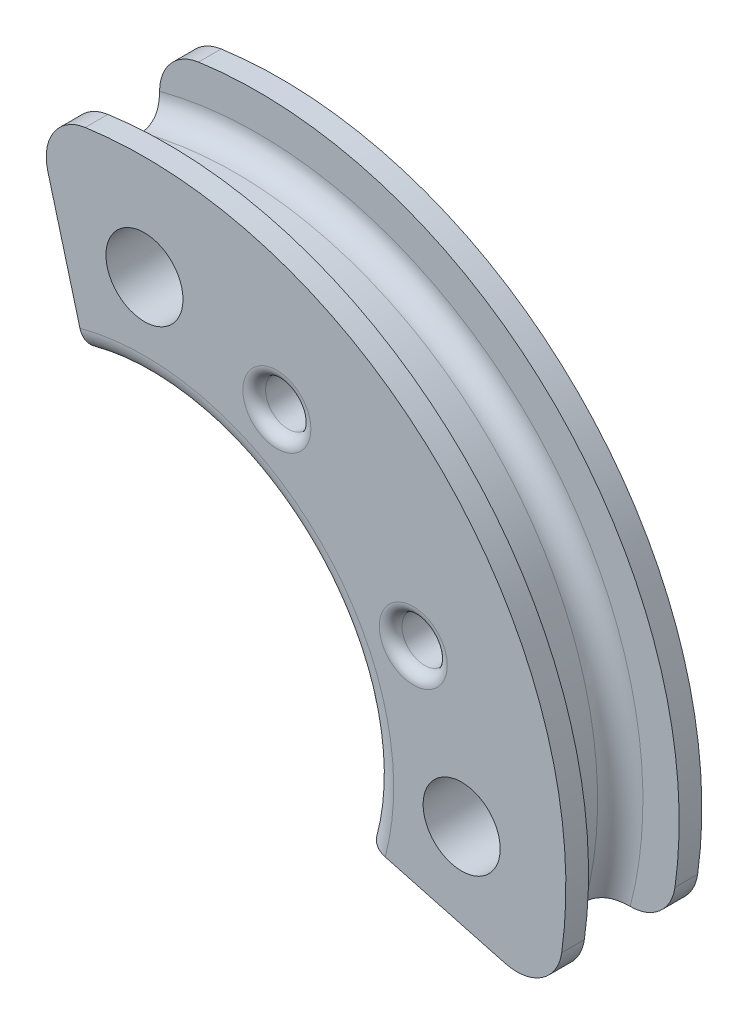
ISO-10303-21;
HEADER;
FILE_DESCRIPTION(('STEP AP214'),'2;1');
FILE_NAME('part.step','',(''),(''),'','','');
FILE_SCHEMA(('AUTOMOTIVE_DESIGN { 1 0 10303 214 1 1 1 1 }'));
ENDSEC;
DATA;
#1=APPLICATION_CONTEXT('core data for automotive mechanical design processes');
#2=APPLICATION_PROTOCOL_DEFINITION('international standard','automotive_design',2000,#1);
#3=PRODUCT_CONTEXT('',#1,'mechanical');
#4=PRODUCT('Part','Part','',(#3));
#5=PRODUCT_RELATED_PRODUCT_CATEGORY('part','',(#4));
#6=PRODUCT_DEFINITION_FORMATION('','',#4);
#7=PRODUCT_DEFINITION_CONTEXT('part definition',#1,'design');
#8=PRODUCT_DEFINITION('design','',#6,#7);
#9=PRODUCT_DEFINITION_SHAPE('','',#8);
#10=(LENGTH_UNIT() NAMED_UNIT(*) SI_UNIT(.MILLI.,.METRE.));
#11=(NAMED_UNIT(*) PLANE_ANGLE_UNIT() SI_UNIT($,.RADIAN.));
#12=(NAMED_UNIT(*) SI_UNIT($,.STERADIAN.) SOLID_ANGLE_UNIT());
#13=UNCERTAINTY_MEASURE_WITH_UNIT(LENGTH_MEASURE(1.E-05),#10,'distance_accuracy_value','');
#14=(GEOMETRIC_REPRESENTATION_CONTEXT(3) GLOBAL_UNCERTAINTY_ASSIGNED_CONTEXT((#13)) GLOBAL_UNIT_ASSIGNED_CONTEXT((#10,
#11,#12)) REPRESENTATION_CONTEXT('',''));
#15=CARTESIAN_POINT('',(0.,0.,0.));
#16=DIRECTION('',(0.,0.,1.));
#17=DIRECTION('',(1.,0.,0.));
#18=AXIS2_PLACEMENT_3D('',#15,#16,#17);
#19=CARTESIAN_POINT('',(0.,0.,1.5));
#20=DIRECTION('',(0.,0.,1.));
#21=DIRECTION('',(1.,0.,0.));
#22=AXIS2_PLACEMENT_3D('',#19,#20,#21);
#23=PLANE('',#22);
#24=CARTESIAN_POINT('',(5.93230035185212,2.92235083903419,1.5));
#25=DIRECTION('',(0.,0.,1.));
#26=DIRECTION('',(1.,0.,0.));
#27=AXIS2_PLACEMENT_3D('',#24,#25,#26);
#28=CIRCLE('',#27,0.750000000000001);
#29=CARTESIAN_POINT('',(6.68230035185213,2.92235083903419,1.5));
#30=VERTEX_POINT('',#29);
#31=EDGE_CURVE('E345',#30,#30,#28,.F.);
#32=ORIENTED_EDGE('',*,*,#31,.T.);
#33=EDGE_LOOP('',(#32));
#34=FACE_BOUND('',#33,.T.);
#35=CARTESIAN_POINT('',(2.92235083903426,5.93230035185209,1.5));
#36=DIRECTION('',(0.,0.,1.));
#37=DIRECTION('',(1.,0.,0.));
#38=AXIS2_PLACEMENT_3D('',#35,#36,#37);
#39=CIRCLE('',#38,0.750000000000001);
#40=CARTESIAN_POINT('',(3.67235083903426,5.93230035185209,1.5));
#41=VERTEX_POINT('',#40);
#42=EDGE_CURVE('E342',#41,#41,#39,.F.);
#43=ORIENTED_EDGE('',*,*,#42,.T.);
#44=EDGE_LOOP('',(#43));
#45=FACE_BOUND('',#44,.T.);
#46=DIRECTION('',(-0.965925826289066,0.258819045102528,0.));
#47=VECTOR('',#46,1.);
#48=CARTESIAN_POINT('',(10.3501453744562,-2.77331309463034,1.5));
#49=LINE('',#48,#47);
#50=CARTESIAN_POINT('',(7.95878334492544,-2.1325495700071,1.5));
#51=VERTEX_POINT('',#50);
#52=CARTESIAN_POINT('',(5.31259204458986,-1.4235047480639,1.5));
#53=VERTEX_POINT('',#52);
#54=EDGE_CURVE('E362',#51,#53,#49,.T.);
#55=ORIENTED_EDGE('',*,*,#54,.F.);
#56=CARTESIAN_POINT('',(8.21760239002796,-1.16662374371804,1.5));
#57=DIRECTION('',(0.,0.,1.));
#58=DIRECTION('',(1.,0.,0.));
#59=AXIS2_PLACEMENT_3D('',#56,#57,#58);
#60=CIRCLE('',#59,1.);
#61=CARTESIAN_POINT('',(9.20767496713977,-1.30718082127443,1.5));
#62=VERTEX_POINT('',#61);
#63=EDGE_CURVE('E457',#51,#62,#60,.T.);
#64=ORIENTED_EDGE('',*,*,#63,.T.);
#65=CARTESIAN_POINT('',(0.,0.,1.5));
#66=DIRECTION('',(0.,0.,1.));
#67=DIRECTION('',(1.,0.,0.));
#68=AXIS2_PLACEMENT_3D('',#65,#66,#67);
#69=CIRCLE('',#68,9.3);
#70=CARTESIAN_POINT('',(-1.30718082127433,9.20767496713978,1.5));
#71=VERTEX_POINT('',#70);
#72=EDGE_CURVE('E508',#62,#71,#69,.T.);
#73=ORIENTED_EDGE('',*,*,#72,.T.);
#74=CARTESIAN_POINT('',(-1.16662374371795,8.21760239002798,1.5));
#75=DIRECTION('',(0.,0.,1.));
#76=DIRECTION('',(1.,0.,0.));
#77=AXIS2_PLACEMENT_3D('',#74,#75,#76);
#78=CIRCLE('',#77,1.);
#79=CARTESIAN_POINT('',(-2.13254957000702,7.95878334492546,1.5));
#80=VERTEX_POINT('',#79);
#81=EDGE_CURVE('E455',#71,#80,#78,.T.);
#82=ORIENTED_EDGE('',*,*,#81,.T.);
#83=DIRECTION('',(-0.258819045102518,0.965925826289069,0.));
#84=VECTOR('',#83,1.);
#85=CARTESIAN_POINT('',(-2.65426315247376,9.90584494169013,1.5));
#86=LINE('',#85,#84);
#87=CARTESIAN_POINT('',(-1.42350474806385,5.31259204458988,1.5));
#88=VERTEX_POINT('',#87);
#89=EDGE_CURVE('E485',#88,#80,#86,.T.);
#90=ORIENTED_EDGE('',*,*,#89,.F.);
#91=CARTESIAN_POINT('',(0.,0.,1.5));
#92=DIRECTION('',(0.,0.,1.));
#93=DIRECTION('',(1.,0.,0.));
#94=AXIS2_PLACEMENT_3D('',#91,#92,#93);
#95=CIRCLE('',#94,5.5);
#96=EDGE_CURVE('E208',#88,#53,#95,.F.);
#97=ORIENTED_EDGE('',*,*,#96,.T.);
#98=EDGE_LOOP('',(#55,#64,#73,#82,#90,#97));
#99=FACE_BOUND('',#98,.T.);
#100=CARTESIAN_POINT('',(7.,0.,1.5));
#101=DIRECTION('',(0.,0.,1.));
#102=DIRECTION('',(1.,0.,0.));
#103=AXIS2_PLACEMENT_3D('',#100,#101,#102);
#104=CIRCLE('',#103,0.849999999999999);
#105=CARTESIAN_POINT('',(7.85,0.,1.5));
#106=VERTEX_POINT('',#105);
#107=EDGE_CURVE('E196',#106,#106,#104,.T.);
#108=ORIENTED_EDGE('',*,*,#107,.F.);
#109=EDGE_LOOP('',(#108));
#110=FACE_BOUND('',#109,.T.);
#111=CARTESIAN_POINT('',(0.,7.,1.5));
#112=DIRECTION('',(0.,0.,1.));
#113=DIRECTION('',(1.,0.,0.));
#114=AXIS2_PLACEMENT_3D('',#111,#112,#113);
#115=CIRCLE('',#114,0.85);
#116=CARTESIAN_POINT('',(0.850000000000001,7.,1.5));
#117=VERTEX_POINT('',#116);
#118=EDGE_CURVE('E187',#117,#117,#115,.T.);
#119=ORIENTED_EDGE('',*,*,#118,.F.);
#120=EDGE_LOOP('',(#119));
#121=FACE_BOUND('',#120,.T.);
#122=ADVANCED_FACE('F32',(#34,#45,#99,#110,#121),#23,.T.);
#123=CARTESIAN_POINT('',(0.,0.,-1.5));
#124=DIRECTION('',(0.,0.,1.));
#125=DIRECTION('',(1.,0.,0.));
#126=AXIS2_PLACEMENT_3D('',#123,#124,#125);
#127=PLANE('',#126);
#128=CARTESIAN_POINT('',(5.93230035185212,2.92235083903419,-1.5));
#129=DIRECTION('',(0.,0.,1.));
#130=DIRECTION('',(1.,0.,0.));
#131=AXIS2_PLACEMENT_3D('',#128,#129,#130);
#132=CIRCLE('',#131,0.750000000000001);
#133=CARTESIAN_POINT('',(6.68230035185213,2.92235083903419,-1.5));
#134=VERTEX_POINT('',#133);
#135=EDGE_CURVE('E333',#134,#134,#132,.T.);
#136=ORIENTED_EDGE('',*,*,#135,.T.);
#137=EDGE_LOOP('',(#136));
#138=FACE_BOUND('',#137,.T.);
#139=CARTESIAN_POINT('',(2.92235083903426,5.93230035185209,-1.5));
#140=DIRECTION('',(0.,0.,1.));
#141=DIRECTION('',(1.,0.,0.));
#142=AXIS2_PLACEMENT_3D('',#139,#140,#141);
#143=CIRCLE('',#142,0.750000000000001);
#144=CARTESIAN_POINT('',(3.67235083903426,5.93230035185209,-1.5));
#145=VERTEX_POINT('',#144);
#146=EDGE_CURVE('E330',#145,#145,#143,.T.);
#147=ORIENTED_EDGE('',*,*,#146,.T.);
#148=EDGE_LOOP('',(#147));
#149=FACE_BOUND('',#148,.T.);
#150=CARTESIAN_POINT('',(0.,0.,-1.5));
#151=DIRECTION('',(0.,0.,1.));
#152=DIRECTION('',(1.,0.,0.));
#153=AXIS2_PLACEMENT_3D('',#150,#151,#152);
#154=CIRCLE('',#153,5.5);
#155=CARTESIAN_POINT('',(5.46625,0.608367436258737,-1.5));
#156=VERTEX_POINT('',#155);
#157=CARTESIAN_POINT('',(0.608367436258713,5.46625,-1.5));
#158=VERTEX_POINT('',#157);
#159=EDGE_CURVE('E221',#156,#158,#154,.T.);
#160=ORIENTED_EDGE('',*,*,#159,.T.);
#161=CARTESIAN_POINT('',(0.,7.,-1.5));
#162=DIRECTION('',(0.,0.,1.));
#163=DIRECTION('',(1.,0.,0.));
#164=AXIS2_PLACEMENT_3D('',#161,#162,#163);
#165=CIRCLE('',#164,1.65);
#166=CARTESIAN_POINT('',(-0.608367436258712,5.46625,-1.5));
#167=VERTEX_POINT('',#166);
#168=EDGE_CURVE('E478',#158,#167,#165,.T.);
#169=ORIENTED_EDGE('',*,*,#168,.T.);
#170=CARTESIAN_POINT('',(-1.42350474806385,5.31259204458988,-1.5));
#171=VERTEX_POINT('',#170);
#172=EDGE_CURVE('E216',#167,#171,#154,.T.);
#173=ORIENTED_EDGE('',*,*,#172,.T.);
#174=DIRECTION('',(-0.258819045102518,0.965925826289069,0.));
#175=VECTOR('',#174,1.);
#176=CARTESIAN_POINT('',(-2.65426315247376,9.90584494169013,-1.5));
#177=LINE('',#176,#175);
#178=CARTESIAN_POINT('',(-2.13254957000702,7.95878334492546,-1.5));
#179=VERTEX_POINT('',#178);
#180=EDGE_CURVE('E168',#171,#179,#177,.T.);
#181=ORIENTED_EDGE('',*,*,#180,.T.);
#182=CARTESIAN_POINT('',(-1.16662374371795,8.21760239002798,-1.5));
#183=DIRECTION('',(0.,0.,1.));
#184=DIRECTION('',(1.,0.,0.));
#185=AXIS2_PLACEMENT_3D('',#182,#183,#184);
#186=CIRCLE('',#185,1.);
#187=CARTESIAN_POINT('',(-1.30718082127433,9.20767496713978,-1.5));
#188=VERTEX_POINT('',#187);
#189=EDGE_CURVE('E448',#179,#188,#186,.F.);
#190=ORIENTED_EDGE('',*,*,#189,.T.);
#191=CARTESIAN_POINT('',(0.,0.,-1.5));
#192=DIRECTION('',(0.,0.,1.));
#193=DIRECTION('',(1.,0.,0.));
#194=AXIS2_PLACEMENT_3D('',#191,#192,#193);
#195=CIRCLE('',#194,9.3);
#196=CARTESIAN_POINT('',(9.20767496713977,-1.30718082127443,-1.5));
#197=VERTEX_POINT('',#196);
#198=EDGE_CURVE('E440',#197,#188,#195,.T.);
#199=ORIENTED_EDGE('',*,*,#198,.F.);
#200=CARTESIAN_POINT('',(8.21760239002796,-1.16662374371804,-1.5));
#201=DIRECTION('',(0.,0.,1.));
#202=DIRECTION('',(1.,0.,0.));
#203=AXIS2_PLACEMENT_3D('',#200,#201,#202);
#204=CIRCLE('',#203,1.);
#205=CARTESIAN_POINT('',(7.95878334492544,-2.1325495700071,-1.5));
#206=VERTEX_POINT('',#205);
#207=EDGE_CURVE('E447',#197,#206,#204,.F.);
#208=ORIENTED_EDGE('',*,*,#207,.T.);
#209=DIRECTION('',(-0.965925826289066,0.258819045102528,0.));
#210=VECTOR('',#209,1.);
#211=CARTESIAN_POINT('',(10.3501453744562,-2.77331309463034,-1.5));
#212=LINE('',#211,#210);
#213=CARTESIAN_POINT('',(5.31259204458986,-1.4235047480639,-1.5));
#214=VERTEX_POINT('',#213);
#215=EDGE_CURVE('E484',#206,#214,#212,.T.);
#216=ORIENTED_EDGE('',*,*,#215,.T.);
#217=CARTESIAN_POINT('',(5.46625,-0.608367436258739,-1.5));
#218=VERTEX_POINT('',#217);
#219=EDGE_CURVE('E217',#214,#218,#154,.T.);
#220=ORIENTED_EDGE('',*,*,#219,.T.);
#221=CARTESIAN_POINT('',(7.,0.,-1.5));
#222=DIRECTION('',(0.,0.,1.));
#223=DIRECTION('',(1.,0.,0.));
#224=AXIS2_PLACEMENT_3D('',#221,#222,#223);
#225=CIRCLE('',#224,1.65000000000001);
#226=EDGE_CURVE('E474',#218,#156,#225,.T.);
#227=ORIENTED_EDGE('',*,*,#226,.T.);
#228=EDGE_LOOP('',(#160,#169,#173,#181,#190,#199,#208,#216,#220,#227));
#229=FACE_BOUND('',#228,.T.);
#230=ADVANCED_FACE('F288',(#138,#149,#229),#127,.F.);
#231=CARTESIAN_POINT('',(0.,0.,1.5));
#232=DIRECTION('',(0.,0.,-1.));
#233=DIRECTION('',(-1.,0.,0.));
#234=AXIS2_PLACEMENT_3D('',#231,#232,#233);
#235=CYLINDRICAL_SURFACE('',#234,5.);
#236=DIRECTION('',(0.,0.,-1.));
#237=VECTOR('',#236,1.);
#238=CARTESIAN_POINT('',(4.82962913144533,-1.29409522551264,1.5));
#239=LINE('',#238,#237);
#240=CARTESIAN_POINT('',(4.82962913144533,-1.29409522551264,1.));
#241=VERTEX_POINT('',#240);
#242=CARTESIAN_POINT('',(4.82962913144533,-1.29409522551264,-1.));
#243=VERTEX_POINT('',#242);
#244=EDGE_CURVE('E489',#241,#243,#239,.T.);
#245=ORIENTED_EDGE('',*,*,#244,.F.);
#246=CARTESIAN_POINT('',(0.,0.,1.));
#247=DIRECTION('',(0.,0.,1.));
#248=DIRECTION('',(1.,0.,0.));
#249=AXIS2_PLACEMENT_3D('',#246,#247,#248);
#250=CIRCLE('',#249,5.);
#251=CARTESIAN_POINT('',(-1.29409522551259,4.82962913144534,1.));
#252=VERTEX_POINT('',#251);
#253=EDGE_CURVE('E201',#241,#252,#250,.T.);
#254=ORIENTED_EDGE('',*,*,#253,.T.);
#255=DIRECTION('',(0.,0.,-1.));
#256=VECTOR('',#255,1.);
#257=CARTESIAN_POINT('',(-1.29409522551259,4.82962913144534,1.5));
#258=LINE('',#257,#256);
#259=CARTESIAN_POINT('',(-1.29409522551259,4.82962913144534,-1.));
#260=VERTEX_POINT('',#259);
#261=EDGE_CURVE('E497',#260,#252,#258,.F.);
#262=ORIENTED_EDGE('',*,*,#261,.F.);
#263=CARTESIAN_POINT('',(0.,0.,-1.));
#264=DIRECTION('',(0.,0.,1.));
#265=DIRECTION('',(1.,0.,0.));
#266=AXIS2_PLACEMENT_3D('',#263,#264,#265);
#267=CIRCLE('',#266,5.);
#268=EDGE_CURVE('E199',#260,#243,#267,.F.);
#269=ORIENTED_EDGE('',*,*,#268,.T.);
#270=EDGE_LOOP('',(#245,#254,#262,#269));
#271=FACE_BOUND('',#270,.T.);
#272=ADVANCED_FACE('F294',(#271),#235,.F.);
#273=CARTESIAN_POINT('',(7.,0.,1.5));
#274=DIRECTION('',(0.,0.,-1.));
#275=DIRECTION('',(-1.,0.,0.));
#276=AXIS2_PLACEMENT_3D('',#273,#274,#275);
#277=CYLINDRICAL_SURFACE('',#276,0.849999999999999);
#278=CARTESIAN_POINT('',(7.,0.,-0.699999999999995));
#279=DIRECTION('',(0.,0.,1.));
#280=DIRECTION('',(1.,0.,0.));
#281=AXIS2_PLACEMENT_3D('',#278,#279,#280);
#282=CIRCLE('',#281,0.849999999999999);
#283=CARTESIAN_POINT('',(7.85,0.,-0.699999999999995));
#284=VERTEX_POINT('',#283);
#285=EDGE_CURVE('E327',#284,#284,#282,.F.);
#286=ORIENTED_EDGE('',*,*,#285,.T.);
#287=EDGE_LOOP('',(#286));
#288=FACE_BOUND('',#287,.T.);
#289=ORIENTED_EDGE('',*,*,#107,.T.);
#290=EDGE_LOOP('',(#289));
#291=FACE_BOUND('',#290,.T.);
#292=ADVANCED_FACE('F368',(#288,#291),#277,.F.);
#293=CARTESIAN_POINT('',(0.,7.,1.5));
#294=DIRECTION('',(0.,0.,-1.));
#295=DIRECTION('',(-1.,0.,0.));
#296=AXIS2_PLACEMENT_3D('',#293,#294,#295);
#297=CYLINDRICAL_SURFACE('',#296,0.85);
#298=CARTESIAN_POINT('',(0.,7.,-0.699999999999995));
#299=DIRECTION('',(0.,0.,1.));
#300=DIRECTION('',(1.,0.,0.));
#301=AXIS2_PLACEMENT_3D('',#298,#299,#300);
#302=CIRCLE('',#301,0.85);
#303=CARTESIAN_POINT('',(0.850000000000001,7.,-0.699999999999995));
#304=VERTEX_POINT('',#303);
#305=EDGE_CURVE('E324',#304,#304,#302,.F.);
#306=ORIENTED_EDGE('',*,*,#305,.T.);
#307=EDGE_LOOP('',(#306));
#308=FACE_BOUND('',#307,.T.);
#309=ORIENTED_EDGE('',*,*,#118,.T.);
#310=EDGE_LOOP('',(#309));
#311=FACE_BOUND('',#310,.T.);
#312=ADVANCED_FACE('F285',(#308,#311),#297,.F.);
#313=CARTESIAN_POINT('',(0.,0.,-0.499999999999999));
#314=DIRECTION('',(0.,0.,1.));
#315=DIRECTION('',(1.,0.,0.));
#316=AXIS2_PLACEMENT_3D('',#313,#314,#315);
#317=TOROIDAL_SURFACE('',#316,8.5,0.500000000000001);
#318=CARTESIAN_POINT('',(8.21036952345707,-2.19996188337149,-0.499999999999999));
#319=DIRECTION('',(0.258819045102528,0.965925826289066,0.));
#320=DIRECTION('',(-0.965925826289067,0.258819045102528,0.));
#321=AXIS2_PLACEMENT_3D('',#318,#319,#320);
#322=CIRCLE('',#321,0.500000000000001);
#323=CARTESIAN_POINT('',(7.95878334492544,-2.1325495700071,-0.92680203230387));
#324=VERTEX_POINT('',#323);
#325=CARTESIAN_POINT('',(7.72740661031253,-2.07055236082022,-0.499999999999999));
#326=VERTEX_POINT('',#325);
#327=EDGE_CURVE('E504',#324,#326,#322,.T.);
#328=ORIENTED_EDGE('',*,*,#327,.F.);
#329=CARTESIAN_POINT('',(7.95878334492544,-2.1325495700071,-0.92680203230387));
#330=CARTESIAN_POINT('',(7.98032312676728,-2.1383521577099,-0.940458247360537));
#331=CARTESIAN_POINT('',(8.00315172706614,-2.14366644102367,-0.952309263321304));
#332=CARTESIAN_POINT('',(8.05008081458118,-2.15276681468098,-0.971949154373012));
#333=CARTESIAN_POINT('',(8.07413510467996,-2.15658785745952,-0.979832365841142));
#334=CARTESIAN_POINT('',(8.11816081402254,-2.16186027066998,-0.990524061954298));
#335=CARTESIAN_POINT('',(8.13792128141101,-2.16364171413765,-0.994052781450043));
#336=CARTESIAN_POINT('',(8.17819400886892,-2.16605713893131,-0.998819381859687));
#337=CARTESIAN_POINT('',(8.19871339056958,-2.16666717532724,-1.00000946956246));
#338=CARTESIAN_POINT('',(8.21923033471833,-2.1666224186152,-1.));
#339=B_SPLINE_CURVE_WITH_KNOTS('',3,(#329,#330,#331,#332,#333,#334,#335,#336,#337,#338),
.UNSPECIFIED.,.F.,.F.,(4,2,2,2,4),(0.,0.0783956304048873,0.154827082050498,0.215112414137625,
0.276617452457446),.UNSPECIFIED.);
#340=CARTESIAN_POINT('',(8.21923033471833,-2.16662241861519,-1.));
#341=VERTEX_POINT('',#340);
#342=EDGE_CURVE('E234',#324,#341,#339,.T.);
#343=ORIENTED_EDGE('',*,*,#342,.T.);
#344=CARTESIAN_POINT('',(0.,0.,-1.));
#345=DIRECTION('',(0.,0.,1.));
#346=DIRECTION('',(1.,0.,0.));
#347=AXIS2_PLACEMENT_3D('',#344,#345,#346);
#348=CIRCLE('',#347,8.5);
#349=CARTESIAN_POINT('',(-2.16662241861512,8.21923033471835,-1.));
#350=VERTEX_POINT('',#349);
#351=EDGE_CURVE('E190',#341,#350,#348,.T.);
#352=ORIENTED_EDGE('',*,*,#351,.T.);
#353=CARTESIAN_POINT('',(-2.16662241861512,8.21923033471835,-1.));
#354=CARTESIAN_POINT('',(-2.16670178233861,8.19307503880606,-1.00003724409534));
#355=CARTESIAN_POINT('',(-2.16568233287674,8.16690361720526,-0.998084843299811));
#356=CARTESIAN_POINT('',(-2.16175537254433,8.11596352609852,-0.990311504084287));
#357=CARTESIAN_POINT('',(-2.15889577707815,8.09117614124369,-0.984588656266716));
#358=CARTESIAN_POINT('',(-2.15234841258296,8.04813446073007,-0.970989152095519));
#359=CARTESIAN_POINT('',(-2.14896313895612,8.02960609001122,-0.963822721265301));
#360=CARTESIAN_POINT('',(-2.14134102498127,7.9933737424651,-0.947100013858474));
#361=CARTESIAN_POINT('',(-2.13708834014832,7.97569403191458,-0.93749831558258));
#362=CARTESIAN_POINT('',(-2.13254957000702,7.95878334492546,-0.92680203230387));
#363=B_SPLINE_CURVE_WITH_KNOTS('',3,(#353,#354,#355,#356,#357,#358,#359,#360,#361,#362),
.UNSPECIFIED.,.F.,.F.,(4,2,2,2,4),(0.,0.0783932173873378,0.154823502964689,0.215110524856777,
0.276617382951252),.UNSPECIFIED.);
#364=CARTESIAN_POINT('',(-2.13254957000702,7.95878334492546,-0.926802032303871));
#365=VERTEX_POINT('',#364);
#366=EDGE_CURVE('E227',#350,#365,#363,.T.);
#367=ORIENTED_EDGE('',*,*,#366,.T.);
#368=CARTESIAN_POINT('',(-2.1999618833714,8.21036952345709,-0.499999999999999));
#369=DIRECTION('',(0.965925826289069,0.258819045102518,0.));
#370=DIRECTION('',(-0.258819045102518,0.965925826289069,0.));
#371=AXIS2_PLACEMENT_3D('',#368,#369,#370);
#372=CIRCLE('',#371,0.500000000000001);
#373=CARTESIAN_POINT('',(-2.07055236082014,7.72740661031255,-0.499999999999999));
#374=VERTEX_POINT('',#373);
#375=EDGE_CURVE('E178',#374,#365,#372,.T.);
#376=ORIENTED_EDGE('',*,*,#375,.F.);
#377=CARTESIAN_POINT('',(0.,0.,-0.499999999999999));
#378=DIRECTION('',(0.,0.,1.));
#379=DIRECTION('',(1.,0.,0.));
#380=AXIS2_PLACEMENT_3D('',#377,#378,#379);
#381=CIRCLE('',#380,8.);
#382=EDGE_CURVE('E177',#326,#374,#381,.T.);
#383=ORIENTED_EDGE('',*,*,#382,.F.);
#384=EDGE_LOOP('',(#328,#343,#352,#367,#376,#383));
#385=FACE_BOUND('',#384,.T.);
#386=ADVANCED_FACE('F240',(#385),#317,.F.);
#387=CARTESIAN_POINT('',(0.,0.,0.));
#388=DIRECTION('',(0.,0.,1.));
#389=DIRECTION('',(1.,0.,0.));
#390=AXIS2_PLACEMENT_3D('',#387,#388,#389);
#391=CYLINDRICAL_SURFACE('',#390,8.);
#392=DIRECTION('',(0.,0.,1.));
#393=VECTOR('',#392,1.);
#394=CARTESIAN_POINT('',(7.72740661031253,-2.07055236082022,0.));
#395=LINE('',#394,#393);
#396=CARTESIAN_POINT('',(7.72740661031253,-2.07055236082022,0.499999999999999));
#397=VERTEX_POINT('',#396);
#398=EDGE_CURVE('E499',#326,#397,#395,.T.);
#399=ORIENTED_EDGE('',*,*,#398,.F.);
#400=ORIENTED_EDGE('',*,*,#382,.T.);
#401=DIRECTION('',(0.,0.,1.));
#402=VECTOR('',#401,1.);
#403=CARTESIAN_POINT('',(-2.07055236082014,7.72740661031255,0.));
#404=LINE('',#403,#402);
#405=CARTESIAN_POINT('',(-2.07055236082014,7.72740661031255,0.499999999999999));
#406=VERTEX_POINT('',#405);
#407=EDGE_CURVE('E161',#406,#374,#404,.F.);
#408=ORIENTED_EDGE('',*,*,#407,.F.);
#409=CARTESIAN_POINT('',(0.,0.,0.499999999999999));
#410=DIRECTION('',(0.,0.,1.));
#411=DIRECTION('',(1.,0.,0.));
#412=AXIS2_PLACEMENT_3D('',#409,#410,#411);
#413=CIRCLE('',#412,8.);
#414=EDGE_CURVE('E175',#397,#406,#413,.T.);
#415=ORIENTED_EDGE('',*,*,#414,.F.);
#416=EDGE_LOOP('',(#399,#400,#408,#415));
#417=FACE_BOUND('',#416,.T.);
#418=ADVANCED_FACE('F174',(#417),#391,.T.);
#419=CARTESIAN_POINT('',(0.,0.,0.5));
#420=DIRECTION('',(0.,0.,1.));
#421=DIRECTION('',(1.,0.,0.));
#422=AXIS2_PLACEMENT_3D('',#419,#420,#421);
#423=TOROIDAL_SURFACE('',#422,8.5,0.5);
#424=CARTESIAN_POINT('',(0.,0.,1.));
#425=DIRECTION('',(0.,0.,1.));
#426=DIRECTION('',(1.,0.,0.));
#427=AXIS2_PLACEMENT_3D('',#424,#425,#426);
#428=CIRCLE('',#427,8.5);
#429=CARTESIAN_POINT('',(8.21923033471833,-2.1666224186152,1.));
#430=VERTEX_POINT('',#429);
#431=CARTESIAN_POINT('',(-2.16662241861511,8.21923033471836,1.));
#432=VERTEX_POINT('',#431);
#433=EDGE_CURVE('E185',#430,#432,#428,.T.);
#434=ORIENTED_EDGE('',*,*,#433,.F.);
#435=CARTESIAN_POINT('',(8.21923033471833,-2.1666224186152,1.));
#436=CARTESIAN_POINT('',(8.19307503880604,-2.1667017823387,1.00003724409534));
#437=CARTESIAN_POINT('',(8.16690361720524,-2.16568233287683,0.99808484329981));
#438=CARTESIAN_POINT('',(8.11596352609849,-2.16175537254441,0.990311504084287));
#439=CARTESIAN_POINT('',(8.09117614124367,-2.15889577707823,0.984588656266716));
#440=CARTESIAN_POINT('',(8.04813446073005,-2.15234841258304,0.970989152095519));
#441=CARTESIAN_POINT('',(8.02960609001119,-2.1489631389562,0.9638227212653));
#442=CARTESIAN_POINT('',(7.99337374246508,-2.14134102498135,0.947100013858472));
#443=CARTESIAN_POINT('',(7.97569403191455,-2.1370883401484,0.937498315582579));
#444=CARTESIAN_POINT('',(7.95878334492544,-2.1325495700071,0.926802032303869));
#445=B_SPLINE_CURVE_WITH_KNOTS('',3,(#435,#436,#437,#438,#439,#440,#441,#442,#443,#444),
.UNSPECIFIED.,.F.,.F.,(4,2,2,2,4),(0.,0.0783932173873378,0.154823502964689,0.215110524856779,
0.276617382951254),.UNSPECIFIED.);
#446=CARTESIAN_POINT('',(7.95878334492544,-2.1325495700071,0.92680203230387));
#447=VERTEX_POINT('',#446);
#448=EDGE_CURVE('E268',#430,#447,#445,.T.);
#449=ORIENTED_EDGE('',*,*,#448,.T.);
#450=CARTESIAN_POINT('',(8.21036952345707,-2.19996188337149,0.5));
#451=DIRECTION('',(0.258819045102528,0.965925826289066,0.));
#452=DIRECTION('',(-0.965925826289067,0.258819045102528,0.));
#453=AXIS2_PLACEMENT_3D('',#450,#451,#452);
#454=CIRCLE('',#453,0.5);
#455=EDGE_CURVE('E184',#397,#447,#454,.T.);
#456=ORIENTED_EDGE('',*,*,#455,.F.);
#457=ORIENTED_EDGE('',*,*,#414,.T.);
#458=CARTESIAN_POINT('',(-2.1999618833714,8.21036952345709,0.5));
#459=DIRECTION('',(0.965925826289069,0.258819045102518,0.));
#460=DIRECTION('',(-0.258819045102518,0.965925826289069,0.));
#461=AXIS2_PLACEMENT_3D('',#458,#459,#460);
#462=CIRCLE('',#461,0.5);
#463=CARTESIAN_POINT('',(-2.13254957000702,7.95878334492546,0.926802032303871));
#464=VERTEX_POINT('',#463);
#465=EDGE_CURVE('E157',#464,#406,#462,.T.);
#466=ORIENTED_EDGE('',*,*,#465,.F.);
#467=CARTESIAN_POINT('',(-2.13254957000702,7.95878334492546,0.926802032303871));
#468=CARTESIAN_POINT('',(-2.13835215770982,7.9803231267673,0.940458247360537));
#469=CARTESIAN_POINT('',(-2.14366644102359,8.00315172706616,0.952309263321304));
#470=CARTESIAN_POINT('',(-2.1527668146809,8.05008081458121,0.971949154373012));
#471=CARTESIAN_POINT('',(-2.15658785745944,8.07413510467998,0.979832365841142));
#472=CARTESIAN_POINT('',(-2.1618602706699,8.11816081402256,0.990524061954299));
#473=CARTESIAN_POINT('',(-2.16364171413756,8.13792128141103,0.994052781450043));
#474=CARTESIAN_POINT('',(-2.16605713893123,8.17819400886894,0.998819381859687));
#475=CARTESIAN_POINT('',(-2.16666717532716,8.1987133905696,1.00000946956246));
#476=CARTESIAN_POINT('',(-2.16662241861512,8.21923033471836,1.));
#477=B_SPLINE_CURVE_WITH_KNOTS('',3,(#467,#468,#469,#470,#471,#472,#473,#474,#475,#476),
.UNSPECIFIED.,.F.,.F.,(4,2,2,2,4),(0.,0.0783956304048865,0.154827082050496,0.215112414137622,
0.276617452457447),.UNSPECIFIED.);
#478=EDGE_CURVE('E261',#464,#432,#477,.T.);
#479=ORIENTED_EDGE('',*,*,#478,.T.);
#480=EDGE_LOOP('',(#434,#449,#456,#457,#466,#479));
#481=FACE_BOUND('',#480,.T.);
#482=ADVANCED_FACE('F182',(#481),#423,.F.);
#483=CARTESIAN_POINT('',(8.5,0.,-1.));
#484=DIRECTION('',(0.,0.,1.));
#485=DIRECTION('',(1.,0.,0.));
#486=AXIS2_PLACEMENT_3D('',#483,#484,#485);
#487=PLANE('',#486);
#488=ORIENTED_EDGE('',*,*,#351,.F.);
#489=CARTESIAN_POINT('',(8.21760239002796,-1.16662374371804,-1.));
#490=DIRECTION('',(0.,0.,1.));
#491=DIRECTION('',(1.,0.,0.));
#492=AXIS2_PLACEMENT_3D('',#489,#490,#491);
#493=CIRCLE('',#492,1.);
#494=CARTESIAN_POINT('',(9.20767496713977,-1.30718082127443,-1.));
#495=VERTEX_POINT('',#494);
#496=EDGE_CURVE('E445',#341,#495,#493,.T.);
#497=ORIENTED_EDGE('',*,*,#496,.T.);
#498=CARTESIAN_POINT('',(0.,0.,-1.));
#499=DIRECTION('',(0.,0.,1.));
#500=DIRECTION('',(1.,0.,0.));
#501=AXIS2_PLACEMENT_3D('',#498,#499,#500);
#502=CIRCLE('',#501,9.3);
#503=CARTESIAN_POINT('',(-1.30718082127433,9.20767496713978,-1.));
#504=VERTEX_POINT('',#503);
#505=EDGE_CURVE('E432',#495,#504,#502,.T.);
#506=ORIENTED_EDGE('',*,*,#505,.T.);
#507=CARTESIAN_POINT('',(-1.16662374371795,8.21760239002798,-1.));
#508=DIRECTION('',(0.,0.,1.));
#509=DIRECTION('',(1.,0.,0.));
#510=AXIS2_PLACEMENT_3D('',#507,#508,#509);
#511=CIRCLE('',#510,1.);
#512=EDGE_CURVE('E516',#504,#350,#511,.T.);
#513=ORIENTED_EDGE('',*,*,#512,.T.);
#514=EDGE_LOOP('',(#488,#497,#506,#513));
#515=FACE_BOUND('',#514,.T.);
#516=ADVANCED_FACE('F278',(#515),#487,.T.);
#517=CARTESIAN_POINT('',(0.,0.,0.));
#518=DIRECTION('',(0.,0.,1.));
#519=DIRECTION('',(1.,0.,0.));
#520=AXIS2_PLACEMENT_3D('',#517,#518,#519);
#521=CYLINDRICAL_SURFACE('',#520,9.3);
#522=ORIENTED_EDGE('',*,*,#505,.F.);
#523=DIRECTION('',(0.,0.,1.));
#524=VECTOR('',#523,1.);
#525=CARTESIAN_POINT('',(9.20767496713977,-1.30718082127443,0.));
#526=LINE('',#525,#524);
#527=EDGE_CURVE('E435',#495,#197,#526,.F.);
#528=ORIENTED_EDGE('',*,*,#527,.T.);
#529=ORIENTED_EDGE('',*,*,#198,.T.);
#530=DIRECTION('',(0.,0.,1.));
#531=VECTOR('',#530,1.);
#532=CARTESIAN_POINT('',(-1.30718082127433,9.20767496713978,0.));
#533=LINE('',#532,#531);
#534=EDGE_CURVE('E438',#188,#504,#533,.T.);
#535=ORIENTED_EDGE('',*,*,#534,.T.);
#536=EDGE_LOOP('',(#522,#528,#529,#535));
#537=FACE_BOUND('',#536,.T.);
#538=ADVANCED_FACE('F422',(#537),#521,.T.);
#539=CARTESIAN_POINT('',(0.,0.,0.));
#540=DIRECTION('',(0.,0.,1.));
#541=DIRECTION('',(1.,0.,0.));
#542=AXIS2_PLACEMENT_3D('',#539,#540,#541);
#543=CYLINDRICAL_SURFACE('',#542,9.3);
#544=ORIENTED_EDGE('',*,*,#72,.F.);
#545=DIRECTION('',(0.,0.,1.));
#546=VECTOR('',#545,1.);
#547=CARTESIAN_POINT('',(9.20767496713977,-1.30718082127443,0.));
#548=LINE('',#547,#546);
#549=CARTESIAN_POINT('',(9.20767496713977,-1.30718082127443,1.));
#550=VERTEX_POINT('',#549);
#551=EDGE_CURVE('E461',#62,#550,#548,.F.);
#552=ORIENTED_EDGE('',*,*,#551,.T.);
#553=CARTESIAN_POINT('',(0.,0.,1.));
#554=DIRECTION('',(0.,0.,1.));
#555=DIRECTION('',(1.,0.,0.));
#556=AXIS2_PLACEMENT_3D('',#553,#554,#555);
#557=CIRCLE('',#556,9.3);
#558=CARTESIAN_POINT('',(-1.30718082127433,9.20767496713978,1.));
#559=VERTEX_POINT('',#558);
#560=EDGE_CURVE('E467',#550,#559,#557,.T.);
#561=ORIENTED_EDGE('',*,*,#560,.T.);
#562=DIRECTION('',(0.,0.,1.));
#563=VECTOR('',#562,1.);
#564=CARTESIAN_POINT('',(-1.30718082127433,9.20767496713978,0.));
#565=LINE('',#564,#563);
#566=EDGE_CURVE('E459',#559,#71,#565,.T.);
#567=ORIENTED_EDGE('',*,*,#566,.T.);
#568=EDGE_LOOP('',(#544,#552,#561,#567));
#569=FACE_BOUND('',#568,.T.);
#570=ADVANCED_FACE('F419',(#569),#543,.T.);
#571=CARTESIAN_POINT('',(8.5,0.,1.));
#572=DIRECTION('',(0.,0.,-1.));
#573=DIRECTION('',(-1.,0.,0.));
#574=AXIS2_PLACEMENT_3D('',#571,#572,#573);
#575=PLANE('',#574);
#576=ORIENTED_EDGE('',*,*,#560,.F.);
#577=CARTESIAN_POINT('',(8.21760239002796,-1.16662374371804,1.));
#578=DIRECTION('',(0.,0.,-1.));
#579=DIRECTION('',(-1.,0.,0.));
#580=AXIS2_PLACEMENT_3D('',#577,#578,#579);
#581=CIRCLE('',#580,1.);
#582=EDGE_CURVE('E269',#550,#430,#581,.T.);
#583=ORIENTED_EDGE('',*,*,#582,.T.);
#584=ORIENTED_EDGE('',*,*,#433,.T.);
#585=CARTESIAN_POINT('',(-1.16662374371795,8.21760239002798,1.));
#586=DIRECTION('',(0.,0.,-1.));
#587=DIRECTION('',(-1.,0.,0.));
#588=AXIS2_PLACEMENT_3D('',#585,#586,#587);
#589=CIRCLE('',#588,1.);
#590=EDGE_CURVE('E462',#432,#559,#589,.T.);
#591=ORIENTED_EDGE('',*,*,#590,.T.);
#592=EDGE_LOOP('',(#576,#583,#584,#591));
#593=FACE_BOUND('',#592,.T.);
#594=ADVANCED_FACE('F415',(#593),#575,.T.);
#595=CARTESIAN_POINT('',(-2.65426315247376,9.90584494169013,-1.5));
#596=DIRECTION('',(0.965925826289069,0.258819045102518,0.));
#597=DIRECTION('',(-0.258819045102518,0.965925826289069,0.));
#598=AXIS2_PLACEMENT_3D('',#595,#596,#597);
#599=PLANE('',#598);
#600=ORIENTED_EDGE('',*,*,#375,.T.);
#601=DIRECTION('',(0.,0.,-1.));
#602=VECTOR('',#601,1.);
#603=CARTESIAN_POINT('',(-2.13254957000702,7.95878334492546,-1.5));
#604=LINE('',#603,#602);
#605=EDGE_CURVE('E472',#365,#179,#604,.T.);
#606=ORIENTED_EDGE('',*,*,#605,.T.);
#607=ORIENTED_EDGE('',*,*,#180,.F.);
#608=CARTESIAN_POINT('',(-1.42350474806385,5.31259204458988,-1.));
#609=DIRECTION('',(0.965925826289069,0.258819045102518,0.));
#610=DIRECTION('',(-0.258819045102518,0.965925826289069,0.));
#611=AXIS2_PLACEMENT_3D('',#608,#609,#610);
#612=CIRCLE('',#611,0.5);
#613=EDGE_CURVE('E204',#171,#260,#612,.F.);
#614=ORIENTED_EDGE('',*,*,#613,.T.);
#615=ORIENTED_EDGE('',*,*,#261,.T.);
#616=CARTESIAN_POINT('',(-1.42350474806385,5.31259204458988,1.));
#617=DIRECTION('',(0.965925826289069,0.258819045102518,0.));
#618=DIRECTION('',(-0.258819045102518,0.965925826289069,0.));
#619=AXIS2_PLACEMENT_3D('',#616,#617,#618);
#620=CIRCLE('',#619,0.5);
#621=EDGE_CURVE('E206',#252,#88,#620,.F.);
#622=ORIENTED_EDGE('',*,*,#621,.T.);
#623=ORIENTED_EDGE('',*,*,#89,.T.);
#624=DIRECTION('',(0.,0.,-1.));
#625=VECTOR('',#624,1.);
#626=CARTESIAN_POINT('',(-2.13254957000702,7.95878334492546,1.));
#627=LINE('',#626,#625);
#628=EDGE_CURVE('E165',#80,#464,#627,.T.);
#629=ORIENTED_EDGE('',*,*,#628,.T.);
#630=ORIENTED_EDGE('',*,*,#465,.T.);
#631=ORIENTED_EDGE('',*,*,#407,.T.);
#632=EDGE_LOOP('',(#600,#606,#607,#614,#615,#622,#623,#629,#630,#631));
#633=FACE_BOUND('',#632,.T.);
#634=ADVANCED_FACE('F160',(#633),#599,.F.);
#635=CARTESIAN_POINT('',(10.3501453744562,-2.77331309463034,-1.5));
#636=DIRECTION('',(0.258819045102528,0.965925826289066,0.));
#637=DIRECTION('',(-0.965925826289067,0.258819045102528,0.));
#638=AXIS2_PLACEMENT_3D('',#635,#636,#637);
#639=PLANE('',#638);
#640=ORIENTED_EDGE('',*,*,#215,.F.);
#641=DIRECTION('',(0.,0.,-1.));
#642=VECTOR('',#641,1.);
#643=CARTESIAN_POINT('',(7.95878334492544,-2.1325495700071,-1.));
#644=LINE('',#643,#642);
#645=EDGE_CURVE('E224',#206,#324,#644,.F.);
#646=ORIENTED_EDGE('',*,*,#645,.T.);
#647=ORIENTED_EDGE('',*,*,#327,.T.);
#648=ORIENTED_EDGE('',*,*,#398,.T.);
#649=ORIENTED_EDGE('',*,*,#455,.T.);
#650=DIRECTION('',(0.,0.,-1.));
#651=VECTOR('',#650,1.);
#652=CARTESIAN_POINT('',(7.95878334492544,-2.1325495700071,1.5));
#653=LINE('',#652,#651);
#654=EDGE_CURVE('E220',#447,#51,#653,.F.);
#655=ORIENTED_EDGE('',*,*,#654,.T.);
#656=ORIENTED_EDGE('',*,*,#54,.T.);
#657=CARTESIAN_POINT('',(5.31259204458987,-1.4235047480639,1.));
#658=DIRECTION('',(0.258819045102528,0.965925826289066,0.));
#659=DIRECTION('',(-0.965925826289067,0.258819045102528,0.));
#660=AXIS2_PLACEMENT_3D('',#657,#658,#659);
#661=CIRCLE('',#660,0.5);
#662=EDGE_CURVE('E214',#53,#241,#661,.F.);
#663=ORIENTED_EDGE('',*,*,#662,.T.);
#664=ORIENTED_EDGE('',*,*,#244,.T.);
#665=CARTESIAN_POINT('',(5.31259204458987,-1.4235047480639,-1.));
#666=DIRECTION('',(0.258819045102528,0.965925826289066,0.));
#667=DIRECTION('',(-0.965925826289067,0.258819045102528,0.));
#668=AXIS2_PLACEMENT_3D('',#665,#666,#667);
#669=CIRCLE('',#668,0.5);
#670=EDGE_CURVE('E211',#243,#214,#669,.F.);
#671=ORIENTED_EDGE('',*,*,#670,.T.);
#672=EDGE_LOOP('',(#640,#646,#647,#648,#649,#655,#656,#663,#664,#671));
#673=FACE_BOUND('',#672,.T.);
#674=ADVANCED_FACE('F402',(#673),#639,.F.);
#675=CARTESIAN_POINT('',(5.93230035185212,2.92235083903419,-1.5));
#676=DIRECTION('',(0.,0.,1.));
#677=DIRECTION('',(1.,0.,0.));
#678=AXIS2_PLACEMENT_3D('',#675,#676,#677);
#679=CYLINDRICAL_SURFACE('',#678,0.500000000000001);
#680=CARTESIAN_POINT('',(5.93230035185212,2.92235083903419,-1.25));
#681=DIRECTION('',(0.,0.,1.));
#682=DIRECTION('',(1.,0.,0.));
#683=AXIS2_PLACEMENT_3D('',#680,#681,#682);
#684=CIRCLE('',#683,0.500000000000001);
#685=CARTESIAN_POINT('',(6.43230035185213,2.92235083903419,-1.25));
#686=VERTEX_POINT('',#685);
#687=EDGE_CURVE('E339',#686,#686,#684,.F.);
#688=ORIENTED_EDGE('',*,*,#687,.T.);
#689=EDGE_LOOP('',(#688));
#690=FACE_BOUND('',#689,.T.);
#691=CARTESIAN_POINT('',(5.93230035185212,2.92235083903419,1.25));
#692=DIRECTION('',(0.,0.,1.));
#693=DIRECTION('',(1.,0.,0.));
#694=AXIS2_PLACEMENT_3D('',#691,#692,#693);
#695=CIRCLE('',#694,0.500000000000001);
#696=CARTESIAN_POINT('',(6.43230035185213,2.92235083903419,1.25));
#697=VERTEX_POINT('',#696);
#698=EDGE_CURVE('E336',#697,#697,#695,.T.);
#699=ORIENTED_EDGE('',*,*,#698,.T.);
#700=EDGE_LOOP('',(#699));
#701=FACE_BOUND('',#700,.T.);
#702=ADVANCED_FACE('F400',(#690,#701),#679,.F.);
#703=CARTESIAN_POINT('',(2.92235083903426,5.93230035185209,-1.5));
#704=DIRECTION('',(0.,0.,1.));
#705=DIRECTION('',(1.,0.,0.));
#706=AXIS2_PLACEMENT_3D('',#703,#704,#705);
#707=CYLINDRICAL_SURFACE('',#706,0.500000000000001);
#708=CARTESIAN_POINT('',(2.92235083903426,5.93230035185209,-1.25));
#709=DIRECTION('',(0.,0.,1.));
#710=DIRECTION('',(1.,0.,0.));
#711=AXIS2_PLACEMENT_3D('',#708,#709,#710);
#712=CIRCLE('',#711,0.500000000000001);
#713=CARTESIAN_POINT('',(3.42235083903426,5.93230035185209,-1.25));
#714=VERTEX_POINT('',#713);
#715=EDGE_CURVE('E11',#714,#714,#712,.F.);
#716=ORIENTED_EDGE('',*,*,#715,.T.);
#717=EDGE_LOOP('',(#716));
#718=FACE_BOUND('',#717,.T.);
#719=CARTESIAN_POINT('',(2.92235083903426,5.93230035185209,1.25));
#720=DIRECTION('',(0.,0.,1.));
#721=DIRECTION('',(1.,0.,0.));
#722=AXIS2_PLACEMENT_3D('',#719,#720,#721);
#723=CIRCLE('',#722,0.500000000000001);
#724=CARTESIAN_POINT('',(3.42235083903426,5.93230035185209,1.25));
#725=VERTEX_POINT('',#724);
#726=EDGE_CURVE('E40',#725,#725,#723,.T.);
#727=ORIENTED_EDGE('',*,*,#726,.T.);
#728=EDGE_LOOP('',(#727));
#729=FACE_BOUND('',#728,.T.);
#730=ADVANCED_FACE('F306',(#718,#729),#707,.F.);
#731=CARTESIAN_POINT('',(0.,0.,1.));
#732=DIRECTION('',(0.,0.,1.));
#733=DIRECTION('',(1.,0.,0.));
#734=AXIS2_PLACEMENT_3D('',#731,#732,#733);
#735=TOROIDAL_SURFACE('',#734,5.5,0.5);
#736=ORIENTED_EDGE('',*,*,#662,.F.);
#737=ORIENTED_EDGE('',*,*,#96,.F.);
#738=ORIENTED_EDGE('',*,*,#621,.F.);
#739=ORIENTED_EDGE('',*,*,#253,.F.);
#740=EDGE_LOOP('',(#736,#737,#738,#739));
#741=FACE_BOUND('',#740,.T.);
#742=ADVANCED_FACE('F302',(#741),#735,.T.);
#743=CARTESIAN_POINT('',(0.,0.,-1.));
#744=DIRECTION('',(0.,0.,1.));
#745=DIRECTION('',(1.,0.,0.));
#746=AXIS2_PLACEMENT_3D('',#743,#744,#745);
#747=TOROIDAL_SURFACE('',#746,5.5,0.5);
#748=ORIENTED_EDGE('',*,*,#172,.F.);
#749=CARTESIAN_POINT('',(-0.608367436258712,5.46625,-1.5));
#750=CARTESIAN_POINT('',(-0.592170103257496,5.45982971068976,-1.49999575933397));
#751=CARTESIAN_POINT('',(-0.575808794993912,5.45384752371167,-1.4997999883923));
#752=CARTESIAN_POINT('',(-0.542835292393261,5.44267279359305,-1.4991317682289));
#753=CARTESIAN_POINT('',(-0.526223273222201,5.43747972485665,-1.49865950419311));
#754=CARTESIAN_POINT('',(-0.476171913895013,5.42296529880273,-1.49698944289143));
#755=CARTESIAN_POINT('',(-0.442440897442559,5.41467954800293,-1.49553736185677));
#756=CARTESIAN_POINT('',(-0.374230767823469,5.40031804798133,-1.49250047658584));
#757=CARTESIAN_POINT('',(-0.339747720517118,5.39426185147735,-1.49091464135529));
#758=CARTESIAN_POINT('',(-0.270461197244738,5.38412243482907,-1.4879819305331));
#759=CARTESIAN_POINT('',(-0.235657498720715,5.38004070988048,-1.48663523652131));
#760=CARTESIAN_POINT('',(-0.143031039756909,5.3715393186107,-1.48370315669813));
#761=CARTESIAN_POINT('',(-0.0850503748912218,5.36864678211268,-1.48253837682867));
#762=CARTESIAN_POINT('',(0.0310089177465275,5.36726483596901,-1.48199733934835));
#763=CARTESIAN_POINT('',(0.0890875863846019,5.36877873349828,-1.48262242508529));
#764=CARTESIAN_POINT('',(0.204612628274011,5.37640689930001,-1.48541617959995));
#765=CARTESIAN_POINT('',(0.262060711540007,5.38249808215934,-1.48757709948577));
#766=CARTESIAN_POINT('',(0.376059279526709,5.40008179064446,-1.49251274291192));
#767=CARTESIAN_POINT('',(0.432611262776035,5.41156402790485,-1.49528629198579));
#768=CARTESIAN_POINT('',(0.508564788629518,5.43218286342527,-1.49810323908555));
#769=CARTESIAN_POINT('',(0.528792093475716,5.43819258292879,-1.49876279448884));
#770=CARTESIAN_POINT('',(0.56888039519252,5.45133753064456,-1.49970773088519));
#771=CARTESIAN_POINT('',(0.588741452420394,5.4584725715196,-1.49999317408486));
#772=CARTESIAN_POINT('',(0.608367436258713,5.46625,-1.5));
#773=B_SPLINE_CURVE_WITH_KNOTS('',3,(#749,#750,#751,#752,#753,#754,#755,#756,#757,#758,#759,
#760,#761,#762,#763,#764,#765,#766,#767,#768,#769,#770,#771,#772),.UNSPECIFIED.,.F.,.F.,(4,2,2,
2,2,2,2,2,2,2,2,4),(0.,0.0522491987132539,0.104463442609007,0.208647562311743,0.313724737395579,
0.418881359530603,0.59285927015893,0.766967790643097,0.940204044160726,1.11311102664221,
1.17641395802277,1.239706362187),.UNSPECIFIED.);
#774=EDGE_CURVE('E46',#167,#158,#773,.T.);
#775=ORIENTED_EDGE('',*,*,#774,.T.);
#776=ORIENTED_EDGE('',*,*,#159,.F.);
#777=CARTESIAN_POINT('',(5.46625,0.608367436258737,-1.5));
#778=CARTESIAN_POINT('',(5.45982971068976,0.592170103257521,-1.49999575933397));
#779=CARTESIAN_POINT('',(5.45384752371166,0.575808794993938,-1.4997999883923));
#780=CARTESIAN_POINT('',(5.44267279359305,0.542835292393288,-1.4991317682289));
#781=CARTESIAN_POINT('',(5.43747972485665,0.526223273222229,-1.49865950419311));
#782=CARTESIAN_POINT('',(5.42296529880272,0.476171913895042,-1.49698944289143));
#783=CARTESIAN_POINT('',(5.41467954800292,0.442440897442589,-1.49553736185677));
#784=CARTESIAN_POINT('',(5.40031804798132,0.374230767823502,-1.49250047658584));
#785=CARTESIAN_POINT('',(5.39426185147734,0.339747720517152,-1.49091464135529));
#786=CARTESIAN_POINT('',(5.38412243482907,0.270461197244774,-1.4879819305331));
#787=CARTESIAN_POINT('',(5.38004070988048,0.235657498720752,-1.48663523652131));
#788=CARTESIAN_POINT('',(5.37153931861069,0.143031039756946,-1.48370315669813));
#789=CARTESIAN_POINT('',(5.36864678211267,0.0850503748912563,-1.48253837682867));
#790=CARTESIAN_POINT('',(5.367264835969,-0.0310089177464969,-1.48199733934835));
#791=CARTESIAN_POINT('',(5.36877873349827,-0.0890875863845733,-1.48262242508528));
#792=CARTESIAN_POINT('',(5.3764068993,-0.204612628273987,-1.48541617959994));
#793=CARTESIAN_POINT('',(5.38249808215932,-0.262060711539985,-1.48757709948576));
#794=CARTESIAN_POINT('',(5.40008179064445,-0.376059279526691,-1.49251274291192));
#795=CARTESIAN_POINT('',(5.41156402790484,-0.432611262776019,-1.49528629198579));
#796=CARTESIAN_POINT('',(5.43218286342525,-0.50856478862951,-1.49810323908555));
#797=CARTESIAN_POINT('',(5.43819258292878,-0.528792093475716,-1.49876279448884));
#798=CARTESIAN_POINT('',(5.45133753064455,-0.568880395192533,-1.49970773088519));
#799=CARTESIAN_POINT('',(5.4584725715196,-0.588741452420414,-1.49999317408486));
#800=CARTESIAN_POINT('',(5.46625,-0.608367436258739,-1.5));
#801=B_SPLINE_CURVE_WITH_KNOTS('',3,(#777,#778,#779,#780,#781,#782,#783,#784,#785,#786,#787,
#788,#789,#790,#791,#792,#793,#794,#795,#796,#797,#798,#799,#800),.UNSPECIFIED.,.F.,.F.,(4,2,2,
2,2,2,2,2,2,2,2,4),(0.,0.0522491987132528,0.104463442609005,0.208647562311738,0.31372473739557,
0.418881359530591,0.592859270158924,0.766967790643096,0.940204044160731,1.11311102664222,
1.1764139580228,1.23970636218706),.UNSPECIFIED.);
#802=EDGE_CURVE('E314',#156,#218,#801,.T.);
#803=ORIENTED_EDGE('',*,*,#802,.T.);
#804=ORIENTED_EDGE('',*,*,#219,.F.);
#805=ORIENTED_EDGE('',*,*,#670,.F.);
#806=ORIENTED_EDGE('',*,*,#268,.F.);
#807=ORIENTED_EDGE('',*,*,#613,.F.);
#808=EDGE_LOOP('',(#748,#775,#776,#803,#804,#805,#806,#807));
#809=FACE_BOUND('',#808,.T.);
#810=ADVANCED_FACE('F305',(#809),#747,.T.);
#811=CARTESIAN_POINT('',(8.21760239002796,-1.16662374371804,0.));
#812=DIRECTION('',(0.,0.,1.));
#813=DIRECTION('',(1.,0.,0.));
#814=AXIS2_PLACEMENT_3D('',#811,#812,#813);
#815=CYLINDRICAL_SURFACE('',#814,1.);
#816=ORIENTED_EDGE('',*,*,#207,.F.);
#817=ORIENTED_EDGE('',*,*,#527,.F.);
#818=ORIENTED_EDGE('',*,*,#496,.F.);
#819=ORIENTED_EDGE('',*,*,#342,.F.);
#820=ORIENTED_EDGE('',*,*,#645,.F.);
#821=EDGE_LOOP('',(#816,#817,#818,#819,#820));
#822=FACE_BOUND('',#821,.T.);
#823=ADVANCED_FACE('F310',(#822),#815,.T.);
#824=CARTESIAN_POINT('',(8.21760239002796,-1.16662374371804,0.));
#825=DIRECTION('',(0.,0.,1.));
#826=DIRECTION('',(1.,0.,0.));
#827=AXIS2_PLACEMENT_3D('',#824,#825,#826);
#828=CYLINDRICAL_SURFACE('',#827,1.);
#829=ORIENTED_EDGE('',*,*,#582,.F.);
#830=ORIENTED_EDGE('',*,*,#551,.F.);
#831=ORIENTED_EDGE('',*,*,#63,.F.);
#832=ORIENTED_EDGE('',*,*,#654,.F.);
#833=ORIENTED_EDGE('',*,*,#448,.F.);
#834=EDGE_LOOP('',(#829,#830,#831,#832,#833));
#835=FACE_BOUND('',#834,.T.);
#836=ADVANCED_FACE('F250',(#835),#828,.T.);
#837=CARTESIAN_POINT('',(-1.16662374371795,8.21760239002798,0.));
#838=DIRECTION('',(0.,0.,1.));
#839=DIRECTION('',(1.,0.,0.));
#840=AXIS2_PLACEMENT_3D('',#837,#838,#839);
#841=CYLINDRICAL_SURFACE('',#840,1.);
#842=ORIENTED_EDGE('',*,*,#512,.F.);
#843=ORIENTED_EDGE('',*,*,#534,.F.);
#844=ORIENTED_EDGE('',*,*,#189,.F.);
#845=ORIENTED_EDGE('',*,*,#605,.F.);
#846=ORIENTED_EDGE('',*,*,#366,.F.);
#847=EDGE_LOOP('',(#842,#843,#844,#845,#846));
#848=FACE_BOUND('',#847,.T.);
#849=ADVANCED_FACE('F244',(#848),#841,.T.);
#850=CARTESIAN_POINT('',(-1.16662374371795,8.21760239002798,0.));
#851=DIRECTION('',(0.,0.,1.));
#852=DIRECTION('',(1.,0.,0.));
#853=AXIS2_PLACEMENT_3D('',#850,#851,#852);
#854=CYLINDRICAL_SURFACE('',#853,1.);
#855=ORIENTED_EDGE('',*,*,#81,.F.);
#856=ORIENTED_EDGE('',*,*,#566,.F.);
#857=ORIENTED_EDGE('',*,*,#590,.F.);
#858=ORIENTED_EDGE('',*,*,#478,.F.);
#859=ORIENTED_EDGE('',*,*,#628,.F.);
#860=EDGE_LOOP('',(#855,#856,#857,#858,#859));
#861=FACE_BOUND('',#860,.T.);
#862=ADVANCED_FACE('F249',(#861),#854,.T.);
#863=CARTESIAN_POINT('',(0.,7.,-1.5));
#864=DIRECTION('',(0.,0.,-1.));
#865=DIRECTION('',(-1.,0.,0.));
#866=AXIS2_PLACEMENT_3D('',#863,#864,#865);
#867=CONICAL_SURFACE('',#866,1.65,0.785398163397446);
#868=ORIENTED_EDGE('',*,*,#305,.F.);
#869=EDGE_LOOP('',(#868));
#870=FACE_BOUND('',#869,.T.);
#871=ORIENTED_EDGE('',*,*,#774,.F.);
#872=ORIENTED_EDGE('',*,*,#168,.F.);
#873=EDGE_LOOP('',(#871,#872));
#874=FACE_BOUND('',#873,.T.);
#875=ADVANCED_FACE('F256',(#870,#874),#867,.F.);
#876=CARTESIAN_POINT('',(7.,0.,-1.5));
#877=DIRECTION('',(0.,0.,-1.));
#878=DIRECTION('',(-1.,0.,0.));
#879=AXIS2_PLACEMENT_3D('',#876,#877,#878);
#880=CONICAL_SURFACE('',#879,1.65000000000001,0.785398163397454);
#881=ORIENTED_EDGE('',*,*,#285,.F.);
#882=EDGE_LOOP('',(#881));
#883=FACE_BOUND('',#882,.T.);
#884=ORIENTED_EDGE('',*,*,#802,.F.);
#885=ORIENTED_EDGE('',*,*,#226,.F.);
#886=EDGE_LOOP('',(#884,#885));
#887=FACE_BOUND('',#886,.T.);
#888=ADVANCED_FACE('F377',(#883,#887),#880,.F.);
#889=CARTESIAN_POINT('',(5.93230035185212,2.92235083903419,-1.25));
#890=DIRECTION('',(0.,0.,1.));
#891=DIRECTION('',(1.,0.,0.));
#892=AXIS2_PLACEMENT_3D('',#889,#890,#891);
#893=TOROIDAL_SURFACE('',#892,0.750000000000001,0.25);
#894=ORIENTED_EDGE('',*,*,#687,.F.);
#895=EDGE_LOOP('',(#894));
#896=FACE_BOUND('',#895,.T.);
#897=ORIENTED_EDGE('',*,*,#135,.F.);
#898=EDGE_LOOP('',(#897));
#899=FACE_BOUND('',#898,.T.);
#900=ADVANCED_FACE('F381',(#896,#899),#893,.T.);
#901=CARTESIAN_POINT('',(5.93230035185212,2.92235083903419,1.25));
#902=DIRECTION('',(0.,0.,1.));
#903=DIRECTION('',(1.,0.,0.));
#904=AXIS2_PLACEMENT_3D('',#901,#902,#903);
#905=TOROIDAL_SURFACE('',#904,0.750000000000001,0.25);
#906=ORIENTED_EDGE('',*,*,#31,.F.);
#907=EDGE_LOOP('',(#906));
#908=FACE_BOUND('',#907,.T.);
#909=ORIENTED_EDGE('',*,*,#698,.F.);
#910=EDGE_LOOP('',(#909));
#911=FACE_BOUND('',#910,.T.);
#912=ADVANCED_FACE('F356',(#908,#911),#905,.T.);
#913=CARTESIAN_POINT('',(2.92235083903426,5.93230035185209,-1.25));
#914=DIRECTION('',(0.,0.,1.));
#915=DIRECTION('',(1.,0.,0.));
#916=AXIS2_PLACEMENT_3D('',#913,#914,#915);
#917=TOROIDAL_SURFACE('',#916,0.750000000000001,0.25);
#918=ORIENTED_EDGE('',*,*,#715,.F.);
#919=EDGE_LOOP('',(#918));
#920=FACE_BOUND('',#919,.T.);
#921=ORIENTED_EDGE('',*,*,#146,.F.);
#922=EDGE_LOOP('',(#921));
#923=FACE_BOUND('',#922,.T.);
#924=ADVANCED_FACE('F351',(#920,#923),#917,.T.);
#925=CARTESIAN_POINT('',(2.92235083903426,5.93230035185209,1.25));
#926=DIRECTION('',(0.,0.,1.));
#927=DIRECTION('',(1.,0.,0.));
#928=AXIS2_PLACEMENT_3D('',#925,#926,#927);
#929=TOROIDAL_SURFACE('',#928,0.750000000000001,0.25);
#930=ORIENTED_EDGE('',*,*,#42,.F.);
#931=EDGE_LOOP('',(#930));
#932=FACE_BOUND('',#931,.T.);
#933=ORIENTED_EDGE('',*,*,#726,.F.);
#934=EDGE_LOOP('',(#933));
#935=FACE_BOUND('',#934,.T.);
#936=ADVANCED_FACE('F34',(#932,#935),#929,.T.);
#937=CLOSED_SHELL('',(#122,#230,#272,#292,#312,#386,#418,#482,#516,#538,#570,#594,#634,#674,
#702,#730,#742,#810,#823,#836,#849,#862,#875,#888,#900,#912,#924,#936));
#938=MANIFOLD_SOLID_BREP('B2',#937);
#939=ADVANCED_BREP_SHAPE_REPRESENTATION('',(#18,#938),#14);
#940=SHAPE_DEFINITION_REPRESENTATION(#9,#939);
ENDSEC;
END-ISO-10303-21;
